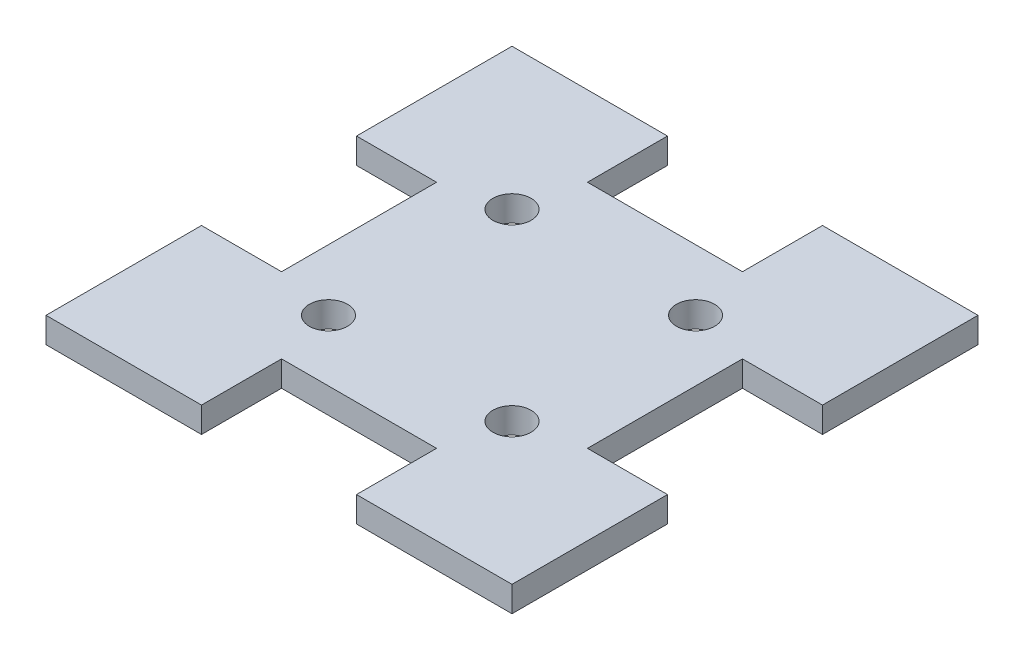
ISO-10303-21;
HEADER;
FILE_DESCRIPTION(('STEP AP214'),'2;1');
FILE_NAME('part.step','',(''),(''),'','','');
FILE_SCHEMA(('AUTOMOTIVE_DESIGN { 1 0 10303 214 1 1 1 1 }'));
ENDSEC;
DATA;
#1=APPLICATION_CONTEXT('core data for automotive mechanical design processes');
#2=APPLICATION_PROTOCOL_DEFINITION('international standard','automotive_design',2000,#1);
#3=PRODUCT_CONTEXT('',#1,'mechanical');
#4=PRODUCT('Part','Part','',(#3));
#5=PRODUCT_RELATED_PRODUCT_CATEGORY('part','',(#4));
#6=PRODUCT_DEFINITION_FORMATION('','',#4);
#7=PRODUCT_DEFINITION_CONTEXT('part definition',#1,'design');
#8=PRODUCT_DEFINITION('design','',#6,#7);
#9=PRODUCT_DEFINITION_SHAPE('','',#8);
#10=(LENGTH_UNIT() NAMED_UNIT(*) SI_UNIT(.MILLI.,.METRE.));
#11=(NAMED_UNIT(*) PLANE_ANGLE_UNIT() SI_UNIT($,.RADIAN.));
#12=(NAMED_UNIT(*) SI_UNIT($,.STERADIAN.) SOLID_ANGLE_UNIT());
#13=UNCERTAINTY_MEASURE_WITH_UNIT(LENGTH_MEASURE(1.E-05),#10,'distance_accuracy_value','');
#14=(GEOMETRIC_REPRESENTATION_CONTEXT(3) GLOBAL_UNCERTAINTY_ASSIGNED_CONTEXT((#13)) GLOBAL_UNIT_ASSIGNED_CONTEXT((#10,
#11,#12)) REPRESENTATION_CONTEXT('',''));
#15=CARTESIAN_POINT('',(0.,0.,0.));
#16=DIRECTION('',(0.,0.,1.));
#17=DIRECTION('',(1.,0.,0.));
#18=AXIS2_PLACEMENT_3D('',#15,#16,#17);
#19=CARTESIAN_POINT('',(-127.827221356237,3.175,19.304));
#20=DIRECTION('',(0.,0.,-1.));
#21=DIRECTION('',(-1.,0.,0.));
#22=AXIS2_PLACEMENT_3D('',#19,#20,#21);
#23=PLANE('',#22);
#24=DIRECTION('',(1.,0.,0.));
#25=VECTOR('',#24,1.);
#26=CARTESIAN_POINT('',(-127.827221356237,-3.175,19.304));
#27=LINE('',#26,#25);
#28=CARTESIAN_POINT('',(38.1,-3.175,19.304));
#29=VERTEX_POINT('',#28);
#30=CARTESIAN_POINT('',(58.039,-3.175,19.304));
#31=VERTEX_POINT('',#30);
#32=EDGE_CURVE('E252',#29,#31,#27,.T.);
#33=ORIENTED_EDGE('',*,*,#32,.F.);
#34=DIRECTION('',(0.,-1.,0.));
#35=VECTOR('',#34,1.);
#36=CARTESIAN_POINT('',(38.1,3.175,19.304));
#37=LINE('',#36,#35);
#38=CARTESIAN_POINT('',(38.1,3.175,19.304));
#39=VERTEX_POINT('',#38);
#40=EDGE_CURVE('E11',#39,#29,#37,.T.);
#41=ORIENTED_EDGE('',*,*,#40,.F.);
#42=DIRECTION('',(1.,0.,0.));
#43=VECTOR('',#42,1.);
#44=CARTESIAN_POINT('',(-127.827221356237,3.175,19.304));
#45=LINE('',#44,#43);
#46=CARTESIAN_POINT('',(58.039,3.175,19.304));
#47=VERTEX_POINT('',#46);
#48=EDGE_CURVE('E242',#39,#47,#45,.T.);
#49=ORIENTED_EDGE('',*,*,#48,.T.);
#50=DIRECTION('',(0.,-1.,0.));
#51=VECTOR('',#50,1.);
#52=CARTESIAN_POINT('',(58.039,3.175,19.304));
#53=LINE('',#52,#51);
#54=EDGE_CURVE('E121',#47,#31,#53,.T.);
#55=ORIENTED_EDGE('',*,*,#54,.T.);
#56=EDGE_LOOP('',(#33,#41,#49,#55));
#57=FACE_BOUND('',#56,.T.);
#58=ADVANCED_FACE('F34',(#57),#23,.T.);
#59=CARTESIAN_POINT('',(38.1,3.175,0.));
#60=DIRECTION('',(1.,0.,0.));
#61=DIRECTION('',(0.,0.,-1.));
#62=AXIS2_PLACEMENT_3D('',#59,#60,#61);
#63=PLANE('',#62);
#64=DIRECTION('',(0.,0.,1.));
#65=VECTOR('',#64,1.);
#66=CARTESIAN_POINT('',(38.1,-3.175,0.));
#67=LINE('',#66,#65);
#68=CARTESIAN_POINT('',(38.1,-3.175,-19.304));
#69=VERTEX_POINT('',#68);
#70=EDGE_CURVE('E315',#69,#29,#67,.T.);
#71=ORIENTED_EDGE('',*,*,#70,.F.);
#72=DIRECTION('',(0.,-1.,0.));
#73=VECTOR('',#72,1.);
#74=CARTESIAN_POINT('',(38.1,3.175,-19.304));
#75=LINE('',#74,#73);
#76=CARTESIAN_POINT('',(38.1,3.175,-19.304));
#77=VERTEX_POINT('',#76);
#78=EDGE_CURVE('E42',#77,#69,#75,.T.);
#79=ORIENTED_EDGE('',*,*,#78,.F.);
#80=DIRECTION('',(0.,0.,1.));
#81=VECTOR('',#80,1.);
#82=CARTESIAN_POINT('',(38.1,3.175,0.));
#83=LINE('',#82,#81);
#84=EDGE_CURVE('E237',#77,#39,#83,.T.);
#85=ORIENTED_EDGE('',*,*,#84,.T.);
#86=ORIENTED_EDGE('',*,*,#40,.T.);
#87=EDGE_LOOP('',(#71,#79,#85,#86));
#88=FACE_BOUND('',#87,.T.);
#89=ADVANCED_FACE('F305',(#88),#63,.T.);
#90=CARTESIAN_POINT('',(-127.827221356237,3.175,-19.304));
#91=DIRECTION('',(0.,0.,-1.));
#92=DIRECTION('',(-1.,0.,0.));
#93=AXIS2_PLACEMENT_3D('',#90,#91,#92);
#94=PLANE('',#93);
#95=DIRECTION('',(1.,0.,0.));
#96=VECTOR('',#95,1.);
#97=CARTESIAN_POINT('',(-127.827221356237,-3.175,-19.304));
#98=LINE('',#97,#96);
#99=CARTESIAN_POINT('',(58.039,-3.175,-19.304));
#100=VERTEX_POINT('',#99);
#101=EDGE_CURVE('E320',#69,#100,#98,.T.);
#102=ORIENTED_EDGE('',*,*,#101,.T.);
#103=DIRECTION('',(0.,-1.,0.));
#104=VECTOR('',#103,1.);
#105=CARTESIAN_POINT('',(58.039,3.175,-19.304));
#106=LINE('',#105,#104);
#107=CARTESIAN_POINT('',(58.039,3.175,-19.304));
#108=VERTEX_POINT('',#107);
#109=EDGE_CURVE('E391',#108,#100,#106,.T.);
#110=ORIENTED_EDGE('',*,*,#109,.F.);
#111=DIRECTION('',(1.,0.,0.));
#112=VECTOR('',#111,1.);
#113=CARTESIAN_POINT('',(-127.827221356237,3.175,-19.304));
#114=LINE('',#113,#112);
#115=EDGE_CURVE('E234',#77,#108,#114,.T.);
#116=ORIENTED_EDGE('',*,*,#115,.F.);
#117=ORIENTED_EDGE('',*,*,#78,.T.);
#118=EDGE_LOOP('',(#102,#110,#116,#117));
#119=FACE_BOUND('',#118,.T.);
#120=ADVANCED_FACE('F309',(#119),#94,.F.);
#121=CARTESIAN_POINT('',(58.039,3.175,0.));
#122=DIRECTION('',(-1.,0.,0.));
#123=DIRECTION('',(0.,0.,1.));
#124=AXIS2_PLACEMENT_3D('',#121,#122,#123);
#125=PLANE('',#124);
#126=DIRECTION('',(0.,0.,-1.));
#127=VECTOR('',#126,1.);
#128=CARTESIAN_POINT('',(58.039,-3.175,0.));
#129=LINE('',#128,#127);
#130=CARTESIAN_POINT('',(58.039,-3.175,-58.039));
#131=VERTEX_POINT('',#130);
#132=EDGE_CURVE('E322',#100,#131,#129,.T.);
#133=ORIENTED_EDGE('',*,*,#132,.T.);
#134=DIRECTION('',(0.,-1.,0.));
#135=VECTOR('',#134,1.);
#136=CARTESIAN_POINT('',(58.039,3.175,-58.039));
#137=LINE('',#136,#135);
#138=CARTESIAN_POINT('',(58.039,3.175,-58.039));
#139=VERTEX_POINT('',#138);
#140=EDGE_CURVE('E389',#139,#131,#137,.T.);
#141=ORIENTED_EDGE('',*,*,#140,.F.);
#142=DIRECTION('',(0.,0.,-1.));
#143=VECTOR('',#142,1.);
#144=CARTESIAN_POINT('',(58.039,3.175,0.));
#145=LINE('',#144,#143);
#146=EDGE_CURVE('E198',#108,#139,#145,.T.);
#147=ORIENTED_EDGE('',*,*,#146,.F.);
#148=ORIENTED_EDGE('',*,*,#109,.T.);
#149=EDGE_LOOP('',(#133,#141,#147,#148));
#150=FACE_BOUND('',#149,.T.);
#151=ADVANCED_FACE('F398',(#150),#125,.F.);
#152=CARTESIAN_POINT('',(-127.827221356237,3.175,-58.039));
#153=DIRECTION('',(0.,0.,-1.));
#154=DIRECTION('',(-1.,0.,0.));
#155=AXIS2_PLACEMENT_3D('',#152,#153,#154);
#156=PLANE('',#155);
#157=DIRECTION('',(1.,0.,0.));
#158=VECTOR('',#157,1.);
#159=CARTESIAN_POINT('',(-127.827221356237,-3.175,-58.039));
#160=LINE('',#159,#158);
#161=CARTESIAN_POINT('',(19.304,-3.175,-58.039));
#162=VERTEX_POINT('',#161);
#163=EDGE_CURVE('E327',#162,#131,#160,.T.);
#164=ORIENTED_EDGE('',*,*,#163,.F.);
#165=DIRECTION('',(0.,-1.,0.));
#166=VECTOR('',#165,1.);
#167=CARTESIAN_POINT('',(19.304,3.175,-58.039));
#168=LINE('',#167,#166);
#169=CARTESIAN_POINT('',(19.304,3.175,-58.039));
#170=VERTEX_POINT('',#169);
#171=EDGE_CURVE('E387',#170,#162,#168,.T.);
#172=ORIENTED_EDGE('',*,*,#171,.F.);
#173=DIRECTION('',(1.,0.,0.));
#174=VECTOR('',#173,1.);
#175=CARTESIAN_POINT('',(-127.827221356237,3.175,-58.039));
#176=LINE('',#175,#174);
#177=EDGE_CURVE('E224',#170,#139,#176,.T.);
#178=ORIENTED_EDGE('',*,*,#177,.T.);
#179=ORIENTED_EDGE('',*,*,#140,.T.);
#180=EDGE_LOOP('',(#164,#172,#178,#179));
#181=FACE_BOUND('',#180,.T.);
#182=ADVANCED_FACE('F400',(#181),#156,.T.);
#183=CARTESIAN_POINT('',(19.304,3.175,0.));
#184=DIRECTION('',(-1.,0.,0.));
#185=DIRECTION('',(0.,0.,1.));
#186=AXIS2_PLACEMENT_3D('',#183,#184,#185);
#187=PLANE('',#186);
#188=DIRECTION('',(0.,0.,-1.));
#189=VECTOR('',#188,1.);
#190=CARTESIAN_POINT('',(19.304,-3.175,0.));
#191=LINE('',#190,#189);
#192=CARTESIAN_POINT('',(19.304,-3.175,-38.1));
#193=VERTEX_POINT('',#192);
#194=EDGE_CURVE('E330',#193,#162,#191,.T.);
#195=ORIENTED_EDGE('',*,*,#194,.F.);
#196=DIRECTION('',(0.,-1.,0.));
#197=VECTOR('',#196,1.);
#198=CARTESIAN_POINT('',(19.304,3.175,-38.1));
#199=LINE('',#198,#197);
#200=CARTESIAN_POINT('',(19.304,3.175,-38.1));
#201=VERTEX_POINT('',#200);
#202=EDGE_CURVE('E385',#201,#193,#199,.T.);
#203=ORIENTED_EDGE('',*,*,#202,.F.);
#204=DIRECTION('',(0.,0.,-1.));
#205=VECTOR('',#204,1.);
#206=CARTESIAN_POINT('',(19.304,3.175,0.));
#207=LINE('',#206,#205);
#208=EDGE_CURVE('E230',#201,#170,#207,.T.);
#209=ORIENTED_EDGE('',*,*,#208,.T.);
#210=ORIENTED_EDGE('',*,*,#171,.T.);
#211=EDGE_LOOP('',(#195,#203,#209,#210));
#212=FACE_BOUND('',#211,.T.);
#213=ADVANCED_FACE('F405',(#212),#187,.T.);
#214=CARTESIAN_POINT('',(-127.827221356237,3.175,-38.1));
#215=DIRECTION('',(0.,0.,1.));
#216=DIRECTION('',(1.,0.,0.));
#217=AXIS2_PLACEMENT_3D('',#214,#215,#216);
#218=PLANE('',#217);
#219=DIRECTION('',(-1.,0.,0.));
#220=VECTOR('',#219,1.);
#221=CARTESIAN_POINT('',(-127.827221356237,-3.175,-38.1));
#222=LINE('',#221,#220);
#223=CARTESIAN_POINT('',(-19.304,-3.175,-38.1));
#224=VERTEX_POINT('',#223);
#225=EDGE_CURVE('E334',#193,#224,#222,.T.);
#226=ORIENTED_EDGE('',*,*,#225,.T.);
#227=DIRECTION('',(0.,-1.,0.));
#228=VECTOR('',#227,1.);
#229=CARTESIAN_POINT('',(-19.304,3.175,-38.1));
#230=LINE('',#229,#228);
#231=CARTESIAN_POINT('',(-19.304,3.175,-38.1));
#232=VERTEX_POINT('',#231);
#233=EDGE_CURVE('E382',#232,#224,#230,.T.);
#234=ORIENTED_EDGE('',*,*,#233,.F.);
#235=DIRECTION('',(-1.,0.,0.));
#236=VECTOR('',#235,1.);
#237=CARTESIAN_POINT('',(-127.827221356237,3.175,-38.1));
#238=LINE('',#237,#236);
#239=EDGE_CURVE('E227',#201,#232,#238,.T.);
#240=ORIENTED_EDGE('',*,*,#239,.F.);
#241=ORIENTED_EDGE('',*,*,#202,.T.);
#242=EDGE_LOOP('',(#226,#234,#240,#241));
#243=FACE_BOUND('',#242,.T.);
#244=ADVANCED_FACE('F413',(#243),#218,.F.);
#245=CARTESIAN_POINT('',(-19.304,3.175,0.));
#246=DIRECTION('',(-1.,0.,0.));
#247=DIRECTION('',(0.,0.,1.));
#248=AXIS2_PLACEMENT_3D('',#245,#246,#247);
#249=PLANE('',#248);
#250=DIRECTION('',(0.,0.,-1.));
#251=VECTOR('',#250,1.);
#252=CARTESIAN_POINT('',(-19.304,-3.175,0.));
#253=LINE('',#252,#251);
#254=CARTESIAN_POINT('',(-19.304,-3.175,-58.039));
#255=VERTEX_POINT('',#254);
#256=EDGE_CURVE('E336',#224,#255,#253,.T.);
#257=ORIENTED_EDGE('',*,*,#256,.T.);
#258=DIRECTION('',(0.,-1.,0.));
#259=VECTOR('',#258,1.);
#260=CARTESIAN_POINT('',(-19.304,3.175,-58.039));
#261=LINE('',#260,#259);
#262=CARTESIAN_POINT('',(-19.304,3.175,-58.039));
#263=VERTEX_POINT('',#262);
#264=EDGE_CURVE('E380',#263,#255,#261,.T.);
#265=ORIENTED_EDGE('',*,*,#264,.F.);
#266=DIRECTION('',(0.,0.,-1.));
#267=VECTOR('',#266,1.);
#268=CARTESIAN_POINT('',(-19.304,3.175,0.));
#269=LINE('',#268,#267);
#270=EDGE_CURVE('E222',#232,#263,#269,.T.);
#271=ORIENTED_EDGE('',*,*,#270,.F.);
#272=ORIENTED_EDGE('',*,*,#233,.T.);
#273=EDGE_LOOP('',(#257,#265,#271,#272));
#274=FACE_BOUND('',#273,.T.);
#275=ADVANCED_FACE('F415',(#274),#249,.F.);
#276=CARTESIAN_POINT('',(-58.039,-3.175,-58.039));
#277=VERTEX_POINT('',#276);
#278=EDGE_CURVE('E331',#277,#255,#160,.T.);
#279=ORIENTED_EDGE('',*,*,#278,.F.);
#280=DIRECTION('',(0.,-1.,0.));
#281=VECTOR('',#280,1.);
#282=CARTESIAN_POINT('',(-58.039,3.175,-58.039));
#283=LINE('',#282,#281);
#284=CARTESIAN_POINT('',(-58.039,3.175,-58.039));
#285=VERTEX_POINT('',#284);
#286=EDGE_CURVE('E378',#285,#277,#283,.T.);
#287=ORIENTED_EDGE('',*,*,#286,.F.);
#288=EDGE_CURVE('E217',#285,#263,#176,.T.);
#289=ORIENTED_EDGE('',*,*,#288,.T.);
#290=ORIENTED_EDGE('',*,*,#264,.T.);
#291=EDGE_LOOP('',(#279,#287,#289,#290));
#292=FACE_BOUND('',#291,.T.);
#293=ADVANCED_FACE('F418',(#292),#156,.T.);
#294=CARTESIAN_POINT('',(-58.039,3.175,0.));
#295=DIRECTION('',(-1.,0.,0.));
#296=DIRECTION('',(0.,0.,1.));
#297=AXIS2_PLACEMENT_3D('',#294,#295,#296);
#298=PLANE('',#297);
#299=DIRECTION('',(0.,0.,-1.));
#300=VECTOR('',#299,1.);
#301=CARTESIAN_POINT('',(-58.039,-3.175,0.));
#302=LINE('',#301,#300);
#303=CARTESIAN_POINT('',(-58.039,-3.175,-19.304));
#304=VERTEX_POINT('',#303);
#305=EDGE_CURVE('E339',#304,#277,#302,.T.);
#306=ORIENTED_EDGE('',*,*,#305,.F.);
#307=DIRECTION('',(0.,-1.,0.));
#308=VECTOR('',#307,1.);
#309=CARTESIAN_POINT('',(-58.039,3.175,-19.304));
#310=LINE('',#309,#308);
#311=CARTESIAN_POINT('',(-58.039,3.175,-19.304));
#312=VERTEX_POINT('',#311);
#313=EDGE_CURVE('E376',#312,#304,#310,.T.);
#314=ORIENTED_EDGE('',*,*,#313,.F.);
#315=DIRECTION('',(0.,0.,-1.));
#316=VECTOR('',#315,1.);
#317=CARTESIAN_POINT('',(-58.039,3.175,0.));
#318=LINE('',#317,#316);
#319=EDGE_CURVE('E210',#312,#285,#318,.T.);
#320=ORIENTED_EDGE('',*,*,#319,.T.);
#321=ORIENTED_EDGE('',*,*,#286,.T.);
#322=EDGE_LOOP('',(#306,#314,#320,#321));
#323=FACE_BOUND('',#322,.T.);
#324=ADVANCED_FACE('F422',(#323),#298,.T.);
#325=CARTESIAN_POINT('',(-127.827221356237,3.175,-19.304));
#326=DIRECTION('',(0.,0.,1.));
#327=DIRECTION('',(1.,0.,0.));
#328=AXIS2_PLACEMENT_3D('',#325,#326,#327);
#329=PLANE('',#328);
#330=DIRECTION('',(-1.,0.,0.));
#331=VECTOR('',#330,1.);
#332=CARTESIAN_POINT('',(-127.827221356237,-3.175,-19.304));
#333=LINE('',#332,#331);
#334=CARTESIAN_POINT('',(-38.1,-3.175,-19.304));
#335=VERTEX_POINT('',#334);
#336=EDGE_CURVE('E342',#335,#304,#333,.T.);
#337=ORIENTED_EDGE('',*,*,#336,.F.);
#338=DIRECTION('',(0.,-1.,0.));
#339=VECTOR('',#338,1.);
#340=CARTESIAN_POINT('',(-38.1,3.175,-19.304));
#341=LINE('',#340,#339);
#342=CARTESIAN_POINT('',(-38.1,3.175,-19.304));
#343=VERTEX_POINT('',#342);
#344=EDGE_CURVE('E374',#343,#335,#341,.T.);
#345=ORIENTED_EDGE('',*,*,#344,.F.);
#346=DIRECTION('',(-1.,0.,0.));
#347=VECTOR('',#346,1.);
#348=CARTESIAN_POINT('',(-127.827221356237,3.175,-19.304));
#349=LINE('',#348,#347);
#350=EDGE_CURVE('E216',#343,#312,#349,.T.);
#351=ORIENTED_EDGE('',*,*,#350,.T.);
#352=ORIENTED_EDGE('',*,*,#313,.T.);
#353=EDGE_LOOP('',(#337,#345,#351,#352));
#354=FACE_BOUND('',#353,.T.);
#355=ADVANCED_FACE('F425',(#354),#329,.T.);
#356=CARTESIAN_POINT('',(-38.1,3.175,0.));
#357=DIRECTION('',(1.,0.,0.));
#358=DIRECTION('',(0.,0.,-1.));
#359=AXIS2_PLACEMENT_3D('',#356,#357,#358);
#360=PLANE('',#359);
#361=DIRECTION('',(0.,0.,1.));
#362=VECTOR('',#361,1.);
#363=CARTESIAN_POINT('',(-38.1,-3.175,0.));
#364=LINE('',#363,#362);
#365=CARTESIAN_POINT('',(-38.1,-3.175,19.304));
#366=VERTEX_POINT('',#365);
#367=EDGE_CURVE('E346',#335,#366,#364,.T.);
#368=ORIENTED_EDGE('',*,*,#367,.T.);
#369=DIRECTION('',(0.,-1.,0.));
#370=VECTOR('',#369,1.);
#371=CARTESIAN_POINT('',(-38.1,3.175,19.304));
#372=LINE('',#371,#370);
#373=CARTESIAN_POINT('',(-38.1,3.175,19.304));
#374=VERTEX_POINT('',#373);
#375=EDGE_CURVE('E371',#374,#366,#372,.T.);
#376=ORIENTED_EDGE('',*,*,#375,.F.);
#377=DIRECTION('',(0.,0.,1.));
#378=VECTOR('',#377,1.);
#379=CARTESIAN_POINT('',(-38.1,3.175,0.));
#380=LINE('',#379,#378);
#381=EDGE_CURVE('E212',#343,#374,#380,.T.);
#382=ORIENTED_EDGE('',*,*,#381,.F.);
#383=ORIENTED_EDGE('',*,*,#344,.T.);
#384=EDGE_LOOP('',(#368,#376,#382,#383));
#385=FACE_BOUND('',#384,.T.);
#386=ADVANCED_FACE('F429',(#385),#360,.F.);
#387=CARTESIAN_POINT('',(-127.827221356237,3.175,19.304));
#388=DIRECTION('',(0.,0.,1.));
#389=DIRECTION('',(1.,0.,0.));
#390=AXIS2_PLACEMENT_3D('',#387,#388,#389);
#391=PLANE('',#390);
#392=DIRECTION('',(-1.,0.,0.));
#393=VECTOR('',#392,1.);
#394=CARTESIAN_POINT('',(-127.827221356237,-3.175,19.304));
#395=LINE('',#394,#393);
#396=CARTESIAN_POINT('',(-58.039,-3.175,19.304));
#397=VERTEX_POINT('',#396);
#398=EDGE_CURVE('E348',#366,#397,#395,.T.);
#399=ORIENTED_EDGE('',*,*,#398,.T.);
#400=DIRECTION('',(0.,-1.,0.));
#401=VECTOR('',#400,1.);
#402=CARTESIAN_POINT('',(-58.039,3.175,19.304));
#403=LINE('',#402,#401);
#404=CARTESIAN_POINT('',(-58.039,3.175,19.304));
#405=VERTEX_POINT('',#404);
#406=EDGE_CURVE('E369',#405,#397,#403,.T.);
#407=ORIENTED_EDGE('',*,*,#406,.F.);
#408=DIRECTION('',(-1.,0.,0.));
#409=VECTOR('',#408,1.);
#410=CARTESIAN_POINT('',(-127.827221356237,3.175,19.304));
#411=LINE('',#410,#409);
#412=EDGE_CURVE('E208',#374,#405,#411,.T.);
#413=ORIENTED_EDGE('',*,*,#412,.F.);
#414=ORIENTED_EDGE('',*,*,#375,.T.);
#415=EDGE_LOOP('',(#399,#407,#413,#414));
#416=FACE_BOUND('',#415,.T.);
#417=ADVANCED_FACE('F434',(#416),#391,.F.);
#418=CARTESIAN_POINT('',(-58.039,-3.175,58.039));
#419=VERTEX_POINT('',#418);
#420=EDGE_CURVE('E343',#419,#397,#302,.T.);
#421=ORIENTED_EDGE('',*,*,#420,.F.);
#422=DIRECTION('',(0.,-1.,0.));
#423=VECTOR('',#422,1.);
#424=CARTESIAN_POINT('',(-58.039,3.175,58.039));
#425=LINE('',#424,#423);
#426=CARTESIAN_POINT('',(-58.039,3.175,58.039));
#427=VERTEX_POINT('',#426);
#428=EDGE_CURVE('E367',#427,#419,#425,.T.);
#429=ORIENTED_EDGE('',*,*,#428,.F.);
#430=EDGE_CURVE('E202',#427,#405,#318,.T.);
#431=ORIENTED_EDGE('',*,*,#430,.T.);
#432=ORIENTED_EDGE('',*,*,#406,.T.);
#433=EDGE_LOOP('',(#421,#429,#431,#432));
#434=FACE_BOUND('',#433,.T.);
#435=ADVANCED_FACE('F438',(#434),#298,.T.);
#436=CARTESIAN_POINT('',(-127.827221356237,3.175,58.039));
#437=DIRECTION('',(0.,0.,-1.));
#438=DIRECTION('',(-1.,0.,0.));
#439=AXIS2_PLACEMENT_3D('',#436,#437,#438);
#440=PLANE('',#439);
#441=DIRECTION('',(1.,0.,0.));
#442=VECTOR('',#441,1.);
#443=CARTESIAN_POINT('',(-127.827221356237,-3.175,58.039));
#444=LINE('',#443,#442);
#445=CARTESIAN_POINT('',(-19.304,-3.175,58.039));
#446=VERTEX_POINT('',#445);
#447=EDGE_CURVE('E351',#419,#446,#444,.T.);
#448=ORIENTED_EDGE('',*,*,#447,.T.);
#449=DIRECTION('',(0.,-1.,0.));
#450=VECTOR('',#449,1.);
#451=CARTESIAN_POINT('',(-19.304,3.175,58.039));
#452=LINE('',#451,#450);
#453=CARTESIAN_POINT('',(-19.304,3.175,58.039));
#454=VERTEX_POINT('',#453);
#455=EDGE_CURVE('E365',#454,#446,#452,.T.);
#456=ORIENTED_EDGE('',*,*,#455,.F.);
#457=DIRECTION('',(1.,0.,0.));
#458=VECTOR('',#457,1.);
#459=CARTESIAN_POINT('',(-127.827221356237,3.175,58.039));
#460=LINE('',#459,#458);
#461=EDGE_CURVE('E196',#427,#454,#460,.T.);
#462=ORIENTED_EDGE('',*,*,#461,.F.);
#463=ORIENTED_EDGE('',*,*,#428,.T.);
#464=EDGE_LOOP('',(#448,#456,#462,#463));
#465=FACE_BOUND('',#464,.T.);
#466=ADVANCED_FACE('F443',(#465),#440,.F.);
#467=CARTESIAN_POINT('',(-19.304,3.175,0.));
#468=DIRECTION('',(1.,0.,0.));
#469=DIRECTION('',(0.,0.,-1.));
#470=AXIS2_PLACEMENT_3D('',#467,#468,#469);
#471=PLANE('',#470);
#472=DIRECTION('',(0.,0.,1.));
#473=VECTOR('',#472,1.);
#474=CARTESIAN_POINT('',(-19.304,-3.175,0.));
#475=LINE('',#474,#473);
#476=CARTESIAN_POINT('',(-19.304,-3.175,38.1));
#477=VERTEX_POINT('',#476);
#478=EDGE_CURVE('E354',#477,#446,#475,.T.);
#479=ORIENTED_EDGE('',*,*,#478,.F.);
#480=DIRECTION('',(0.,-1.,0.));
#481=VECTOR('',#480,1.);
#482=CARTESIAN_POINT('',(-19.304,3.175,38.1));
#483=LINE('',#482,#481);
#484=CARTESIAN_POINT('',(-19.304,3.175,38.1));
#485=VERTEX_POINT('',#484);
#486=EDGE_CURVE('E363',#485,#477,#483,.T.);
#487=ORIENTED_EDGE('',*,*,#486,.F.);
#488=DIRECTION('',(0.,0.,1.));
#489=VECTOR('',#488,1.);
#490=CARTESIAN_POINT('',(-19.304,3.175,0.));
#491=LINE('',#490,#489);
#492=EDGE_CURVE('E201',#485,#454,#491,.T.);
#493=ORIENTED_EDGE('',*,*,#492,.T.);
#494=ORIENTED_EDGE('',*,*,#455,.T.);
#495=EDGE_LOOP('',(#479,#487,#493,#494));
#496=FACE_BOUND('',#495,.T.);
#497=ADVANCED_FACE('F445',(#496),#471,.T.);
#498=CARTESIAN_POINT('',(-127.827221356237,3.175,38.1));
#499=DIRECTION('',(0.,0.,-1.));
#500=DIRECTION('',(-1.,0.,0.));
#501=AXIS2_PLACEMENT_3D('',#498,#499,#500);
#502=PLANE('',#501);
#503=DIRECTION('',(1.,0.,0.));
#504=VECTOR('',#503,1.);
#505=CARTESIAN_POINT('',(-127.827221356237,-3.175,38.1));
#506=LINE('',#505,#504);
#507=CARTESIAN_POINT('',(19.304,-3.175,38.1));
#508=VERTEX_POINT('',#507);
#509=EDGE_CURVE('E357',#477,#508,#506,.T.);
#510=ORIENTED_EDGE('',*,*,#509,.T.);
#511=DIRECTION('',(0.,-1.,0.));
#512=VECTOR('',#511,1.);
#513=CARTESIAN_POINT('',(19.304,3.175,38.1));
#514=LINE('',#513,#512);
#515=CARTESIAN_POINT('',(19.304,3.175,38.1));
#516=VERTEX_POINT('',#515);
#517=EDGE_CURVE('E191',#516,#508,#514,.T.);
#518=ORIENTED_EDGE('',*,*,#517,.F.);
#519=DIRECTION('',(1.,0.,0.));
#520=VECTOR('',#519,1.);
#521=CARTESIAN_POINT('',(-127.827221356237,3.175,38.1));
#522=LINE('',#521,#520);
#523=EDGE_CURVE('E182',#485,#516,#522,.T.);
#524=ORIENTED_EDGE('',*,*,#523,.F.);
#525=ORIENTED_EDGE('',*,*,#486,.T.);
#526=EDGE_LOOP('',(#510,#518,#524,#525));
#527=FACE_BOUND('',#526,.T.);
#528=ADVANCED_FACE('F447',(#527),#502,.F.);
#529=CARTESIAN_POINT('',(19.304,3.175,0.));
#530=DIRECTION('',(1.,0.,0.));
#531=DIRECTION('',(0.,0.,-1.));
#532=AXIS2_PLACEMENT_3D('',#529,#530,#531);
#533=PLANE('',#532);
#534=DIRECTION('',(0.,0.,1.));
#535=VECTOR('',#534,1.);
#536=CARTESIAN_POINT('',(19.304,-3.175,0.));
#537=LINE('',#536,#535);
#538=CARTESIAN_POINT('',(19.304,-3.175,58.039));
#539=VERTEX_POINT('',#538);
#540=EDGE_CURVE('E190',#508,#539,#537,.T.);
#541=ORIENTED_EDGE('',*,*,#540,.T.);
#542=DIRECTION('',(0.,-1.,0.));
#543=VECTOR('',#542,1.);
#544=CARTESIAN_POINT('',(19.304,3.175,58.039));
#545=LINE('',#544,#543);
#546=CARTESIAN_POINT('',(19.304,3.175,58.039));
#547=VERTEX_POINT('',#546);
#548=EDGE_CURVE('E187',#547,#539,#545,.T.);
#549=ORIENTED_EDGE('',*,*,#548,.F.);
#550=DIRECTION('',(0.,0.,1.));
#551=VECTOR('',#550,1.);
#552=CARTESIAN_POINT('',(19.304,3.175,0.));
#553=LINE('',#552,#551);
#554=EDGE_CURVE('E175',#516,#547,#553,.T.);
#555=ORIENTED_EDGE('',*,*,#554,.F.);
#556=ORIENTED_EDGE('',*,*,#517,.T.);
#557=EDGE_LOOP('',(#541,#549,#555,#556));
#558=FACE_BOUND('',#557,.T.);
#559=ADVANCED_FACE('F188',(#558),#533,.F.);
#560=CARTESIAN_POINT('',(58.039,-3.175,58.039));
#561=VERTEX_POINT('',#560);
#562=EDGE_CURVE('E114',#539,#561,#444,.T.);
#563=ORIENTED_EDGE('',*,*,#562,.T.);
#564=DIRECTION('',(0.,-1.,0.));
#565=VECTOR('',#564,1.);
#566=CARTESIAN_POINT('',(58.039,3.175,58.039));
#567=LINE('',#566,#565);
#568=CARTESIAN_POINT('',(58.039,3.175,58.039));
#569=VERTEX_POINT('',#568);
#570=EDGE_CURVE('E192',#569,#561,#567,.T.);
#571=ORIENTED_EDGE('',*,*,#570,.F.);
#572=EDGE_CURVE('E179',#547,#569,#460,.T.);
#573=ORIENTED_EDGE('',*,*,#572,.F.);
#574=ORIENTED_EDGE('',*,*,#548,.T.);
#575=EDGE_LOOP('',(#563,#571,#573,#574));
#576=FACE_BOUND('',#575,.T.);
#577=ADVANCED_FACE('F194',(#576),#440,.F.);
#578=EDGE_CURVE('E244',#561,#31,#129,.T.);
#579=ORIENTED_EDGE('',*,*,#578,.T.);
#580=ORIENTED_EDGE('',*,*,#54,.F.);
#581=EDGE_CURVE('E50',#569,#47,#145,.T.);
#582=ORIENTED_EDGE('',*,*,#581,.F.);
#583=ORIENTED_EDGE('',*,*,#570,.T.);
#584=EDGE_LOOP('',(#579,#580,#582,#583));
#585=FACE_BOUND('',#584,.T.);
#586=ADVANCED_FACE('F283',(#585),#125,.F.);
#587=CARTESIAN_POINT('',(-127.827221356237,3.175,0.));
#588=DIRECTION('',(0.,1.,0.));
#589=DIRECTION('',(0.,0.,1.));
#590=AXIS2_PLACEMENT_3D('',#587,#588,#589);
#591=PLANE('',#590);
#592=CARTESIAN_POINT('',(22.86,3.175,-22.86));
#593=DIRECTION('',(0.,1.,0.));
#594=DIRECTION('',(0.,0.,1.));
#595=AXIS2_PLACEMENT_3D('',#592,#593,#594);
#596=CIRCLE('',#595,4.7625);
#597=CARTESIAN_POINT('',(22.86,3.175,-18.0975));
#598=VERTEX_POINT('',#597);
#599=EDGE_CURVE('E265',#598,#598,#596,.T.);
#600=ORIENTED_EDGE('',*,*,#599,.F.);
#601=EDGE_LOOP('',(#600));
#602=FACE_BOUND('',#601,.T.);
#603=CARTESIAN_POINT('',(22.86,3.175,22.86));
#604=DIRECTION('',(0.,1.,0.));
#605=DIRECTION('',(0.,0.,1.));
#606=AXIS2_PLACEMENT_3D('',#603,#604,#605);
#607=CIRCLE('',#606,4.7625);
#608=CARTESIAN_POINT('',(22.86,3.175,27.6225));
#609=VERTEX_POINT('',#608);
#610=EDGE_CURVE('E259',#609,#609,#607,.T.);
#611=ORIENTED_EDGE('',*,*,#610,.F.);
#612=EDGE_LOOP('',(#611));
#613=FACE_BOUND('',#612,.T.);
#614=CARTESIAN_POINT('',(-22.86,3.175,22.86));
#615=DIRECTION('',(0.,1.,0.));
#616=DIRECTION('',(0.,0.,1.));
#617=AXIS2_PLACEMENT_3D('',#614,#615,#616);
#618=CIRCLE('',#617,4.7625);
#619=CARTESIAN_POINT('',(-22.86,3.175,27.6225));
#620=VERTEX_POINT('',#619);
#621=EDGE_CURVE('E253',#620,#620,#618,.T.);
#622=ORIENTED_EDGE('',*,*,#621,.F.);
#623=EDGE_LOOP('',(#622));
#624=FACE_BOUND('',#623,.T.);
#625=CARTESIAN_POINT('',(-22.86,3.175,-22.86));
#626=DIRECTION('',(0.,1.,0.));
#627=DIRECTION('',(0.,0.,1.));
#628=AXIS2_PLACEMENT_3D('',#625,#626,#627);
#629=CIRCLE('',#628,4.7625);
#630=CARTESIAN_POINT('',(-22.86,3.175,-18.0975));
#631=VERTEX_POINT('',#630);
#632=EDGE_CURVE('E245',#631,#631,#629,.T.);
#633=ORIENTED_EDGE('',*,*,#632,.F.);
#634=EDGE_LOOP('',(#633));
#635=FACE_BOUND('',#634,.T.);
#636=ORIENTED_EDGE('',*,*,#48,.F.);
#637=ORIENTED_EDGE('',*,*,#84,.F.);
#638=ORIENTED_EDGE('',*,*,#115,.T.);
#639=ORIENTED_EDGE('',*,*,#146,.T.);
#640=ORIENTED_EDGE('',*,*,#177,.F.);
#641=ORIENTED_EDGE('',*,*,#208,.F.);
#642=ORIENTED_EDGE('',*,*,#239,.T.);
#643=ORIENTED_EDGE('',*,*,#270,.T.);
#644=ORIENTED_EDGE('',*,*,#288,.F.);
#645=ORIENTED_EDGE('',*,*,#319,.F.);
#646=ORIENTED_EDGE('',*,*,#350,.F.);
#647=ORIENTED_EDGE('',*,*,#381,.T.);
#648=ORIENTED_EDGE('',*,*,#412,.T.);
#649=ORIENTED_EDGE('',*,*,#430,.F.);
#650=ORIENTED_EDGE('',*,*,#461,.T.);
#651=ORIENTED_EDGE('',*,*,#492,.F.);
#652=ORIENTED_EDGE('',*,*,#523,.T.);
#653=ORIENTED_EDGE('',*,*,#554,.T.);
#654=ORIENTED_EDGE('',*,*,#572,.T.);
#655=ORIENTED_EDGE('',*,*,#581,.T.);
#656=EDGE_LOOP('',(#636,#637,#638,#639,#640,#641,#642,#643,#644,#645,#646,#647,#648,#649,#650,
#651,#652,#653,#654,#655));
#657=FACE_BOUND('',#656,.T.);
#658=ADVANCED_FACE('F177',(#602,#613,#624,#635,#657),#591,.T.);
#659=CARTESIAN_POINT('',(-127.827221356237,-3.175,0.));
#660=DIRECTION('',(0.,1.,0.));
#661=DIRECTION('',(0.,0.,1.));
#662=AXIS2_PLACEMENT_3D('',#659,#660,#661);
#663=PLANE('',#662);
#664=CARTESIAN_POINT('',(22.86,-3.175,-22.86));
#665=DIRECTION('',(0.,1.,0.));
#666=DIRECTION('',(0.,0.,1.));
#667=AXIS2_PLACEMENT_3D('',#664,#665,#666);
#668=CIRCLE('',#667,4.7625);
#669=CARTESIAN_POINT('',(22.86,-3.175,-18.0975));
#670=VERTEX_POINT('',#669);
#671=EDGE_CURVE('E262',#670,#670,#668,.T.);
#672=ORIENTED_EDGE('',*,*,#671,.T.);
#673=EDGE_LOOP('',(#672));
#674=FACE_BOUND('',#673,.T.);
#675=CARTESIAN_POINT('',(22.86,-3.175,22.86));
#676=DIRECTION('',(0.,1.,0.));
#677=DIRECTION('',(0.,0.,1.));
#678=AXIS2_PLACEMENT_3D('',#675,#676,#677);
#679=CIRCLE('',#678,4.7625);
#680=CARTESIAN_POINT('',(22.86,-3.175,27.6225));
#681=VERTEX_POINT('',#680);
#682=EDGE_CURVE('E256',#681,#681,#679,.T.);
#683=ORIENTED_EDGE('',*,*,#682,.T.);
#684=EDGE_LOOP('',(#683));
#685=FACE_BOUND('',#684,.T.);
#686=CARTESIAN_POINT('',(-22.86,-3.175,22.86));
#687=DIRECTION('',(0.,1.,0.));
#688=DIRECTION('',(0.,0.,1.));
#689=AXIS2_PLACEMENT_3D('',#686,#687,#688);
#690=CIRCLE('',#689,4.7625);
#691=CARTESIAN_POINT('',(-22.86,-3.175,27.6225));
#692=VERTEX_POINT('',#691);
#693=EDGE_CURVE('E249',#692,#692,#690,.T.);
#694=ORIENTED_EDGE('',*,*,#693,.T.);
#695=EDGE_LOOP('',(#694));
#696=FACE_BOUND('',#695,.T.);
#697=CARTESIAN_POINT('',(-22.86,-3.175,-22.86));
#698=DIRECTION('',(0.,1.,0.));
#699=DIRECTION('',(0.,0.,1.));
#700=AXIS2_PLACEMENT_3D('',#697,#698,#699);
#701=CIRCLE('',#700,4.7625);
#702=CARTESIAN_POINT('',(-22.86,-3.175,-18.0975));
#703=VERTEX_POINT('',#702);
#704=EDGE_CURVE('E248',#703,#703,#701,.T.);
#705=ORIENTED_EDGE('',*,*,#704,.T.);
#706=EDGE_LOOP('',(#705));
#707=FACE_BOUND('',#706,.T.);
#708=ORIENTED_EDGE('',*,*,#32,.T.);
#709=ORIENTED_EDGE('',*,*,#578,.F.);
#710=ORIENTED_EDGE('',*,*,#562,.F.);
#711=ORIENTED_EDGE('',*,*,#540,.F.);
#712=ORIENTED_EDGE('',*,*,#509,.F.);
#713=ORIENTED_EDGE('',*,*,#478,.T.);
#714=ORIENTED_EDGE('',*,*,#447,.F.);
#715=ORIENTED_EDGE('',*,*,#420,.T.);
#716=ORIENTED_EDGE('',*,*,#398,.F.);
#717=ORIENTED_EDGE('',*,*,#367,.F.);
#718=ORIENTED_EDGE('',*,*,#336,.T.);
#719=ORIENTED_EDGE('',*,*,#305,.T.);
#720=ORIENTED_EDGE('',*,*,#278,.T.);
#721=ORIENTED_EDGE('',*,*,#256,.F.);
#722=ORIENTED_EDGE('',*,*,#225,.F.);
#723=ORIENTED_EDGE('',*,*,#194,.T.);
#724=ORIENTED_EDGE('',*,*,#163,.T.);
#725=ORIENTED_EDGE('',*,*,#132,.F.);
#726=ORIENTED_EDGE('',*,*,#101,.F.);
#727=ORIENTED_EDGE('',*,*,#70,.T.);
#728=EDGE_LOOP('',(#708,#709,#710,#711,#712,#713,#714,#715,#716,#717,#718,#719,#720,#721,#722,
#723,#724,#725,#726,#727));
#729=FACE_BOUND('',#728,.T.);
#730=ADVANCED_FACE('F271',(#674,#685,#696,#707,#729),#663,.F.);
#731=CARTESIAN_POINT('',(-22.86,-3.175,-22.86));
#732=DIRECTION('',(0.,1.,0.));
#733=DIRECTION('',(0.,0.,1.));
#734=AXIS2_PLACEMENT_3D('',#731,#732,#733);
#735=CYLINDRICAL_SURFACE('',#734,4.7625);
#736=ORIENTED_EDGE('',*,*,#704,.F.);
#737=EDGE_LOOP('',(#736));
#738=FACE_BOUND('',#737,.T.);
#739=ORIENTED_EDGE('',*,*,#632,.T.);
#740=EDGE_LOOP('',(#739));
#741=FACE_BOUND('',#740,.T.);
#742=ADVANCED_FACE('F291',(#738,#741),#735,.F.);
#743=CARTESIAN_POINT('',(-22.86,-3.175,22.86));
#744=DIRECTION('',(0.,1.,0.));
#745=DIRECTION('',(0.,0.,1.));
#746=AXIS2_PLACEMENT_3D('',#743,#744,#745);
#747=CYLINDRICAL_SURFACE('',#746,4.7625);
#748=ORIENTED_EDGE('',*,*,#693,.F.);
#749=EDGE_LOOP('',(#748));
#750=FACE_BOUND('',#749,.T.);
#751=ORIENTED_EDGE('',*,*,#621,.T.);
#752=EDGE_LOOP('',(#751));
#753=FACE_BOUND('',#752,.T.);
#754=ADVANCED_FACE('F293',(#750,#753),#747,.F.);
#755=CARTESIAN_POINT('',(22.86,-3.175,22.86));
#756=DIRECTION('',(0.,1.,0.));
#757=DIRECTION('',(0.,0.,1.));
#758=AXIS2_PLACEMENT_3D('',#755,#756,#757);
#759=CYLINDRICAL_SURFACE('',#758,4.7625);
#760=ORIENTED_EDGE('',*,*,#682,.F.);
#761=EDGE_LOOP('',(#760));
#762=FACE_BOUND('',#761,.T.);
#763=ORIENTED_EDGE('',*,*,#610,.T.);
#764=EDGE_LOOP('',(#763));
#765=FACE_BOUND('',#764,.T.);
#766=ADVANCED_FACE('F277',(#762,#765),#759,.F.);
#767=CARTESIAN_POINT('',(22.86,-3.175,-22.86));
#768=DIRECTION('',(0.,1.,0.));
#769=DIRECTION('',(0.,0.,1.));
#770=AXIS2_PLACEMENT_3D('',#767,#768,#769);
#771=CYLINDRICAL_SURFACE('',#770,4.7625);
#772=ORIENTED_EDGE('',*,*,#671,.F.);
#773=EDGE_LOOP('',(#772));
#774=FACE_BOUND('',#773,.T.);
#775=ORIENTED_EDGE('',*,*,#599,.T.);
#776=EDGE_LOOP('',(#775));
#777=FACE_BOUND('',#776,.T.);
#778=ADVANCED_FACE('F274',(#774,#777),#771,.F.);
#779=CLOSED_SHELL('',(#58,#89,#120,#151,#182,#213,#244,#275,#293,#324,#355,#386,#417,#435,#466,
#497,#528,#559,#577,#586,#658,#730,#742,#754,#766,#778));
#780=MANIFOLD_SOLID_BREP('B2',#779);
#781=ADVANCED_BREP_SHAPE_REPRESENTATION('',(#18,#780),#14);
#782=SHAPE_DEFINITION_REPRESENTATION(#9,#781);
ENDSEC;
END-ISO-10303-21;
